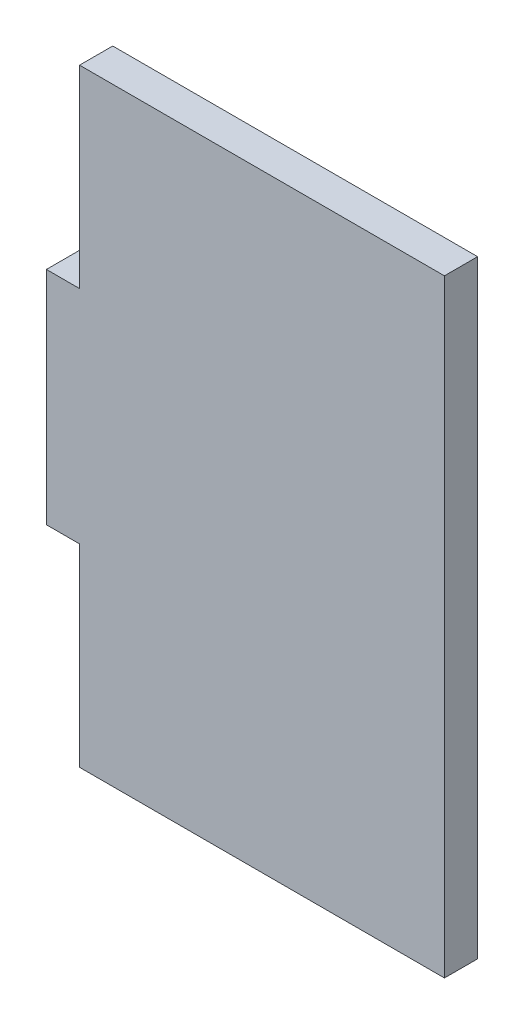
ISO-10303-21;
HEADER;
FILE_DESCRIPTION(('STEP AP214'),'2;1');
FILE_NAME('part.step','',(''),(''),'','','');
FILE_SCHEMA(('AUTOMOTIVE_DESIGN { 1 0 10303 214 1 1 1 1 }'));
ENDSEC;
DATA;
#1=APPLICATION_CONTEXT('core data for automotive mechanical design processes');
#2=APPLICATION_PROTOCOL_DEFINITION('international standard','automotive_design',2000,#1);
#3=PRODUCT_CONTEXT('',#1,'mechanical');
#4=PRODUCT('Part','Part','',(#3));
#5=PRODUCT_RELATED_PRODUCT_CATEGORY('part','',(#4));
#6=PRODUCT_DEFINITION_FORMATION('','',#4);
#7=PRODUCT_DEFINITION_CONTEXT('part definition',#1,'design');
#8=PRODUCT_DEFINITION('design','',#6,#7);
#9=PRODUCT_DEFINITION_SHAPE('','',#8);
#10=(LENGTH_UNIT() NAMED_UNIT(*) SI_UNIT(.MILLI.,.METRE.));
#11=(NAMED_UNIT(*) PLANE_ANGLE_UNIT() SI_UNIT($,.RADIAN.));
#12=(NAMED_UNIT(*) SI_UNIT($,.STERADIAN.) SOLID_ANGLE_UNIT());
#13=UNCERTAINTY_MEASURE_WITH_UNIT(LENGTH_MEASURE(1.E-05),#10,'distance_accuracy_value','');
#14=(GEOMETRIC_REPRESENTATION_CONTEXT(3) GLOBAL_UNCERTAINTY_ASSIGNED_CONTEXT((#13)) GLOBAL_UNIT_ASSIGNED_CONTEXT((#10,
#11,#12)) REPRESENTATION_CONTEXT('',''));
#15=CARTESIAN_POINT('',(0.,0.,0.));
#16=DIRECTION('',(0.,0.,1.));
#17=DIRECTION('',(1.,0.,0.));
#18=AXIS2_PLACEMENT_3D('',#15,#16,#17);
#19=CARTESIAN_POINT('',(-16.5,27.5,3.));
#20=DIRECTION('',(1.,0.,0.));
#21=DIRECTION('',(0.,1.,0.));
#22=AXIS2_PLACEMENT_3D('',#19,#20,#21);
#23=PLANE('',#22);
#24=DIRECTION('',(0.,0.,1.));
#25=VECTOR('',#24,1.);
#26=CARTESIAN_POINT('',(-16.5,-10.,0.));
#27=LINE('',#26,#25);
#28=CARTESIAN_POINT('',(-16.5,-10.,0.));
#29=VERTEX_POINT('',#28);
#30=CARTESIAN_POINT('',(-16.5,-10.,3.));
#31=VERTEX_POINT('',#30);
#32=EDGE_CURVE('E133',#29,#31,#27,.T.);
#33=ORIENTED_EDGE('',*,*,#32,.F.);
#34=DIRECTION('',(0.,-1.,0.));
#35=VECTOR('',#34,1.);
#36=CARTESIAN_POINT('',(-16.5,27.5,0.));
#37=LINE('',#36,#35);
#38=CARTESIAN_POINT('',(-16.5,-27.5,0.));
#39=VERTEX_POINT('',#38);
#40=EDGE_CURVE('E120',#29,#39,#37,.T.);
#41=ORIENTED_EDGE('',*,*,#40,.T.);
#42=DIRECTION('',(0.,0.,-1.));
#43=VECTOR('',#42,1.);
#44=CARTESIAN_POINT('',(-16.5,-27.5,3.));
#45=LINE('',#44,#43);
#46=CARTESIAN_POINT('',(-16.5,-27.5,3.));
#47=VERTEX_POINT('',#46);
#48=EDGE_CURVE('E168',#47,#39,#45,.T.);
#49=ORIENTED_EDGE('',*,*,#48,.F.);
#50=DIRECTION('',(0.,-1.,0.));
#51=VECTOR('',#50,1.);
#52=CARTESIAN_POINT('',(-16.5,27.5,3.));
#53=LINE('',#52,#51);
#54=EDGE_CURVE('E153',#31,#47,#53,.T.);
#55=ORIENTED_EDGE('',*,*,#54,.F.);
#56=EDGE_LOOP('',(#33,#41,#49,#55));
#57=FACE_BOUND('',#56,.T.);
#58=ADVANCED_FACE('F39',(#57),#23,.F.);
#59=CARTESIAN_POINT('',(16.5,27.5,3.));
#60=DIRECTION('',(-1.,0.,0.));
#61=DIRECTION('',(0.,-1.,0.));
#62=AXIS2_PLACEMENT_3D('',#59,#60,#61);
#63=PLANE('',#62);
#64=DIRECTION('',(0.,1.,0.));
#65=VECTOR('',#64,1.);
#66=CARTESIAN_POINT('',(16.5,27.5,0.));
#67=LINE('',#66,#65);
#68=CARTESIAN_POINT('',(16.5,-27.5,0.));
#69=VERTEX_POINT('',#68);
#70=CARTESIAN_POINT('',(16.5,27.5,0.));
#71=VERTEX_POINT('',#70);
#72=EDGE_CURVE('E146',#69,#71,#67,.T.);
#73=ORIENTED_EDGE('',*,*,#72,.T.);
#74=DIRECTION('',(0.,0.,-1.));
#75=VECTOR('',#74,1.);
#76=CARTESIAN_POINT('',(16.5,27.5,3.));
#77=LINE('',#76,#75);
#78=CARTESIAN_POINT('',(16.5,27.5,3.));
#79=VERTEX_POINT('',#78);
#80=EDGE_CURVE('E11',#79,#71,#77,.T.);
#81=ORIENTED_EDGE('',*,*,#80,.F.);
#82=DIRECTION('',(0.,1.,0.));
#83=VECTOR('',#82,1.);
#84=CARTESIAN_POINT('',(16.5,27.5,3.));
#85=LINE('',#84,#83);
#86=CARTESIAN_POINT('',(16.5,-27.5,3.));
#87=VERTEX_POINT('',#86);
#88=EDGE_CURVE('E150',#87,#79,#85,.T.);
#89=ORIENTED_EDGE('',*,*,#88,.F.);
#90=DIRECTION('',(0.,0.,-1.));
#91=VECTOR('',#90,1.);
#92=CARTESIAN_POINT('',(16.5,-27.5,3.));
#93=LINE('',#92,#91);
#94=EDGE_CURVE('E158',#87,#69,#93,.T.);
#95=ORIENTED_EDGE('',*,*,#94,.T.);
#96=EDGE_LOOP('',(#73,#81,#89,#95));
#97=FACE_BOUND('',#96,.T.);
#98=ADVANCED_FACE('F41',(#97),#63,.F.);
#99=CARTESIAN_POINT('',(-16.5,27.5,3.));
#100=DIRECTION('',(0.,-1.,0.));
#101=DIRECTION('',(0.,0.,-1.));
#102=AXIS2_PLACEMENT_3D('',#99,#100,#101);
#103=PLANE('',#102);
#104=DIRECTION('',(-1.,0.,0.));
#105=VECTOR('',#104,1.);
#106=CARTESIAN_POINT('',(-16.5,27.5,0.));
#107=LINE('',#106,#105);
#108=CARTESIAN_POINT('',(-16.5,27.5,0.));
#109=VERTEX_POINT('',#108);
#110=EDGE_CURVE('E161',#71,#109,#107,.T.);
#111=ORIENTED_EDGE('',*,*,#110,.T.);
#112=DIRECTION('',(0.,0.,-1.));
#113=VECTOR('',#112,1.);
#114=CARTESIAN_POINT('',(-16.5,27.5,3.));
#115=LINE('',#114,#113);
#116=CARTESIAN_POINT('',(-16.5,27.5,3.));
#117=VERTEX_POINT('',#116);
#118=EDGE_CURVE('E47',#117,#109,#115,.T.);
#119=ORIENTED_EDGE('',*,*,#118,.F.);
#120=DIRECTION('',(-1.,0.,0.));
#121=VECTOR('',#120,1.);
#122=CARTESIAN_POINT('',(-16.5,27.5,3.));
#123=LINE('',#122,#121);
#124=EDGE_CURVE('E91',#79,#117,#123,.T.);
#125=ORIENTED_EDGE('',*,*,#124,.F.);
#126=ORIENTED_EDGE('',*,*,#80,.T.);
#127=EDGE_LOOP('',(#111,#119,#125,#126));
#128=FACE_BOUND('',#127,.T.);
#129=ADVANCED_FACE('F179',(#128),#103,.F.);
#130=CARTESIAN_POINT('',(-16.5,10.,0.));
#131=VERTEX_POINT('',#130);
#132=EDGE_CURVE('E163',#109,#131,#37,.T.);
#133=ORIENTED_EDGE('',*,*,#132,.T.);
#134=DIRECTION('',(0.,0.,1.));
#135=VECTOR('',#134,1.);
#136=CARTESIAN_POINT('',(-16.5,10.,0.));
#137=LINE('',#136,#135);
#138=CARTESIAN_POINT('',(-16.5,10.,3.));
#139=VERTEX_POINT('',#138);
#140=EDGE_CURVE('E147',#131,#139,#137,.T.);
#141=ORIENTED_EDGE('',*,*,#140,.T.);
#142=EDGE_CURVE('E154',#117,#139,#53,.T.);
#143=ORIENTED_EDGE('',*,*,#142,.F.);
#144=ORIENTED_EDGE('',*,*,#118,.T.);
#145=EDGE_LOOP('',(#133,#141,#143,#144));
#146=FACE_BOUND('',#145,.T.);
#147=ADVANCED_FACE('F173',(#146),#23,.F.);
#148=CARTESIAN_POINT('',(-16.5,-27.5,3.));
#149=DIRECTION('',(0.,1.,0.));
#150=DIRECTION('',(0.,0.,1.));
#151=AXIS2_PLACEMENT_3D('',#148,#149,#150);
#152=PLANE('',#151);
#153=DIRECTION('',(1.,0.,0.));
#154=VECTOR('',#153,1.);
#155=CARTESIAN_POINT('',(-16.5,-27.5,0.));
#156=LINE('',#155,#154);
#157=EDGE_CURVE('E84',#39,#69,#156,.T.);
#158=ORIENTED_EDGE('',*,*,#157,.T.);
#159=ORIENTED_EDGE('',*,*,#94,.F.);
#160=DIRECTION('',(1.,0.,0.));
#161=VECTOR('',#160,1.);
#162=CARTESIAN_POINT('',(-16.5,-27.5,3.));
#163=LINE('',#162,#161);
#164=EDGE_CURVE('E63',#47,#87,#163,.T.);
#165=ORIENTED_EDGE('',*,*,#164,.F.);
#166=ORIENTED_EDGE('',*,*,#48,.T.);
#167=EDGE_LOOP('',(#158,#159,#165,#166));
#168=FACE_BOUND('',#167,.T.);
#169=ADVANCED_FACE('F185',(#168),#152,.F.);
#170=CARTESIAN_POINT('',(0.,0.,3.));
#171=DIRECTION('',(0.,0.,1.));
#172=DIRECTION('',(1.,0.,0.));
#173=AXIS2_PLACEMENT_3D('',#170,#171,#172);
#174=PLANE('',#173);
#175=ORIENTED_EDGE('',*,*,#88,.T.);
#176=ORIENTED_EDGE('',*,*,#124,.T.);
#177=ORIENTED_EDGE('',*,*,#142,.T.);
#178=DIRECTION('',(-1.,0.,0.));
#179=VECTOR('',#178,1.);
#180=CARTESIAN_POINT('',(0.,10.,3.));
#181=LINE('',#180,#179);
#182=CARTESIAN_POINT('',(-19.5,10.,3.));
#183=VERTEX_POINT('',#182);
#184=EDGE_CURVE('E54',#139,#183,#181,.T.);
#185=ORIENTED_EDGE('',*,*,#184,.T.);
#186=DIRECTION('',(0.,1.,0.));
#187=VECTOR('',#186,1.);
#188=CARTESIAN_POINT('',(-19.5,0.,3.));
#189=LINE('',#188,#187);
#190=CARTESIAN_POINT('',(-19.5,-10.,3.));
#191=VERTEX_POINT('',#190);
#192=EDGE_CURVE('E142',#191,#183,#189,.T.);
#193=ORIENTED_EDGE('',*,*,#192,.F.);
#194=DIRECTION('',(-1.,0.,0.));
#195=VECTOR('',#194,1.);
#196=CARTESIAN_POINT('',(0.,-10.,3.));
#197=LINE('',#196,#195);
#198=EDGE_CURVE('E129',#31,#191,#197,.T.);
#199=ORIENTED_EDGE('',*,*,#198,.F.);
#200=ORIENTED_EDGE('',*,*,#54,.T.);
#201=ORIENTED_EDGE('',*,*,#164,.T.);
#202=EDGE_LOOP('',(#175,#176,#177,#185,#193,#199,#200,#201));
#203=FACE_BOUND('',#202,.T.);
#204=ADVANCED_FACE('F175',(#203),#174,.T.);
#205=CARTESIAN_POINT('',(0.,0.,0.));
#206=DIRECTION('',(0.,0.,1.));
#207=DIRECTION('',(1.,0.,0.));
#208=AXIS2_PLACEMENT_3D('',#205,#206,#207);
#209=PLANE('',#208);
#210=ORIENTED_EDGE('',*,*,#72,.F.);
#211=ORIENTED_EDGE('',*,*,#157,.F.);
#212=ORIENTED_EDGE('',*,*,#40,.F.);
#213=DIRECTION('',(-1.,0.,0.));
#214=VECTOR('',#213,1.);
#215=CARTESIAN_POINT('',(0.,-10.,0.));
#216=LINE('',#215,#214);
#217=CARTESIAN_POINT('',(-19.5,-10.,0.));
#218=VERTEX_POINT('',#217);
#219=EDGE_CURVE('E112',#29,#218,#216,.T.);
#220=ORIENTED_EDGE('',*,*,#219,.T.);
#221=DIRECTION('',(0.,1.,0.));
#222=VECTOR('',#221,1.);
#223=CARTESIAN_POINT('',(-19.5,0.,0.));
#224=LINE('',#223,#222);
#225=CARTESIAN_POINT('',(-19.5,10.,0.));
#226=VERTEX_POINT('',#225);
#227=EDGE_CURVE('E118',#218,#226,#224,.T.);
#228=ORIENTED_EDGE('',*,*,#227,.T.);
#229=DIRECTION('',(-1.,0.,0.));
#230=VECTOR('',#229,1.);
#231=CARTESIAN_POINT('',(0.,10.,0.));
#232=LINE('',#231,#230);
#233=EDGE_CURVE('E123',#131,#226,#232,.T.);
#234=ORIENTED_EDGE('',*,*,#233,.F.);
#235=ORIENTED_EDGE('',*,*,#132,.F.);
#236=ORIENTED_EDGE('',*,*,#110,.F.);
#237=EDGE_LOOP('',(#210,#211,#212,#220,#228,#234,#235,#236));
#238=FACE_BOUND('',#237,.T.);
#239=ADVANCED_FACE('F115',(#238),#209,.F.);
#240=CARTESIAN_POINT('',(-19.5,0.,0.));
#241=DIRECTION('',(1.,0.,0.));
#242=DIRECTION('',(0.,0.,-1.));
#243=AXIS2_PLACEMENT_3D('',#240,#241,#242);
#244=PLANE('',#243);
#245=ORIENTED_EDGE('',*,*,#192,.T.);
#246=DIRECTION('',(0.,0.,1.));
#247=VECTOR('',#246,1.);
#248=CARTESIAN_POINT('',(-19.5,10.,0.));
#249=LINE('',#248,#247);
#250=EDGE_CURVE('E136',#226,#183,#249,.T.);
#251=ORIENTED_EDGE('',*,*,#250,.F.);
#252=ORIENTED_EDGE('',*,*,#227,.F.);
#253=DIRECTION('',(0.,0.,1.));
#254=VECTOR('',#253,1.);
#255=CARTESIAN_POINT('',(-19.5,-10.,0.));
#256=LINE('',#255,#254);
#257=EDGE_CURVE('E126',#218,#191,#256,.T.);
#258=ORIENTED_EDGE('',*,*,#257,.T.);
#259=EDGE_LOOP('',(#245,#251,#252,#258));
#260=FACE_BOUND('',#259,.T.);
#261=ADVANCED_FACE('F135',(#260),#244,.F.);
#262=CARTESIAN_POINT('',(0.,10.,0.));
#263=DIRECTION('',(0.,1.,0.));
#264=DIRECTION('',(0.,0.,1.));
#265=AXIS2_PLACEMENT_3D('',#262,#263,#264);
#266=PLANE('',#265);
#267=ORIENTED_EDGE('',*,*,#184,.F.);
#268=ORIENTED_EDGE('',*,*,#140,.F.);
#269=ORIENTED_EDGE('',*,*,#233,.T.);
#270=ORIENTED_EDGE('',*,*,#250,.T.);
#271=EDGE_LOOP('',(#267,#268,#269,#270));
#272=FACE_BOUND('',#271,.T.);
#273=ADVANCED_FACE('F174',(#272),#266,.T.);
#274=CARTESIAN_POINT('',(0.,-10.,0.));
#275=DIRECTION('',(0.,1.,0.));
#276=DIRECTION('',(0.,0.,1.));
#277=AXIS2_PLACEMENT_3D('',#274,#275,#276);
#278=PLANE('',#277);
#279=ORIENTED_EDGE('',*,*,#198,.T.);
#280=ORIENTED_EDGE('',*,*,#257,.F.);
#281=ORIENTED_EDGE('',*,*,#219,.F.);
#282=ORIENTED_EDGE('',*,*,#32,.T.);
#283=EDGE_LOOP('',(#279,#280,#281,#282));
#284=FACE_BOUND('',#283,.T.);
#285=ADVANCED_FACE('F127',(#284),#278,.F.);
#286=CLOSED_SHELL('',(#58,#98,#129,#147,#169,#204,#239,#261,#273,#285));
#287=MANIFOLD_SOLID_BREP('B2',#286);
#288=ADVANCED_BREP_SHAPE_REPRESENTATION('',(#18,#287),#14);
#289=SHAPE_DEFINITION_REPRESENTATION(#9,#288);
ENDSEC;
END-ISO-10303-21;
